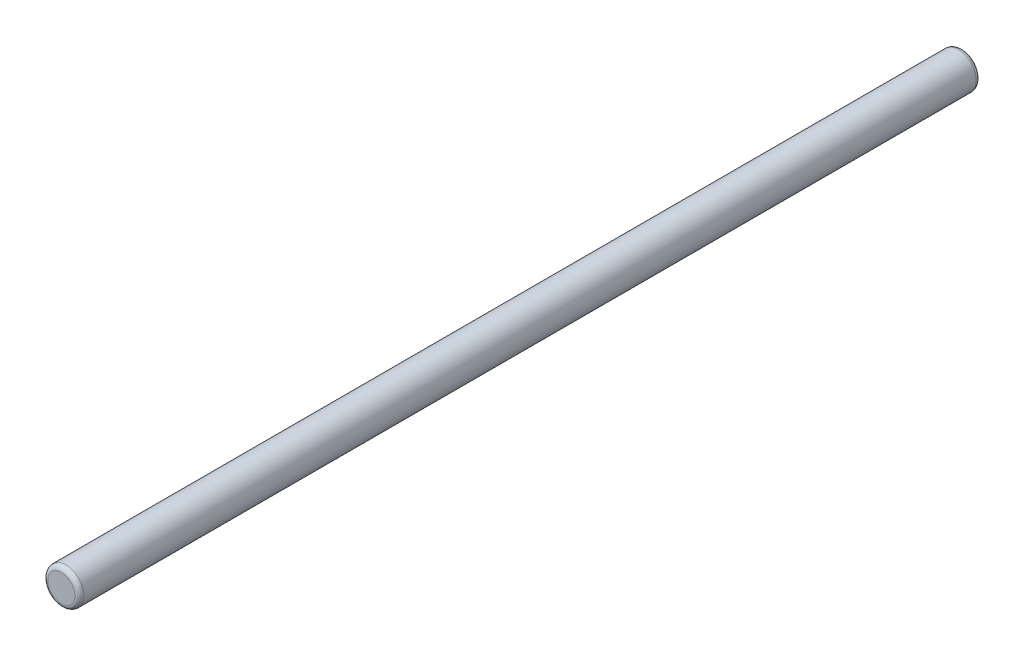
ISO-10303-21;
HEADER;
FILE_DESCRIPTION(('STEP AP214'),'2;1');
FILE_NAME('part.step','',(''),(''),'','','');
FILE_SCHEMA(('AUTOMOTIVE_DESIGN { 1 0 10303 214 1 1 1 1 }'));
ENDSEC;
DATA;
#1=APPLICATION_CONTEXT('core data for automotive mechanical design processes');
#2=APPLICATION_PROTOCOL_DEFINITION('international standard','automotive_design',2000,#1);
#3=PRODUCT_CONTEXT('',#1,'mechanical');
#4=PRODUCT('Part','Part','',(#3));
#5=PRODUCT_RELATED_PRODUCT_CATEGORY('part','',(#4));
#6=PRODUCT_DEFINITION_FORMATION('','',#4);
#7=PRODUCT_DEFINITION_CONTEXT('part definition',#1,'design');
#8=PRODUCT_DEFINITION('design','',#6,#7);
#9=PRODUCT_DEFINITION_SHAPE('','',#8);
#10=(LENGTH_UNIT() NAMED_UNIT(*) SI_UNIT(.MILLI.,.METRE.));
#11=(NAMED_UNIT(*) PLANE_ANGLE_UNIT() SI_UNIT($,.RADIAN.));
#12=(NAMED_UNIT(*) SI_UNIT($,.STERADIAN.) SOLID_ANGLE_UNIT());
#13=UNCERTAINTY_MEASURE_WITH_UNIT(LENGTH_MEASURE(1.E-05),#10,'distance_accuracy_value','');
#14=(GEOMETRIC_REPRESENTATION_CONTEXT(3) GLOBAL_UNCERTAINTY_ASSIGNED_CONTEXT((#13)) GLOBAL_UNIT_ASSIGNED_CONTEXT((#10,
#11,#12)) REPRESENTATION_CONTEXT('',''));
#15=CARTESIAN_POINT('',(0.,0.,0.));
#16=DIRECTION('',(0.,0.,1.));
#17=DIRECTION('',(1.,0.,0.));
#18=AXIS2_PLACEMENT_3D('',#15,#16,#17);
#19=CARTESIAN_POINT('',(0.,0.,200.));
#20=DIRECTION('',(0.,0.,-1.));
#21=DIRECTION('',(-1.,0.,0.));
#22=AXIS2_PLACEMENT_3D('',#19,#20,#21);
#23=PLANE('',#22);
#24=CARTESIAN_POINT('',(0.,0.,200.));
#25=DIRECTION('',(0.,0.,-1.));
#26=DIRECTION('',(1.,0.,0.));
#27=AXIS2_PLACEMENT_3D('',#24,#25,#26);
#28=CIRCLE('',#27,2.99999999999999);
#29=CARTESIAN_POINT('',(2.99999999999999,0.,200.));
#30=VERTEX_POINT('',#29);
#31=EDGE_CURVE('E65',#30,#30,#28,.T.);
#32=ORIENTED_EDGE('',*,*,#31,.F.);
#33=EDGE_LOOP('',(#32));
#34=FACE_BOUND('',#33,.T.);
#35=ADVANCED_FACE('F14',(#34),#23,.F.);
#36=CARTESIAN_POINT('',(0.,0.,0.));
#37=DIRECTION('',(0.,0.,-1.));
#38=DIRECTION('',(-1.,0.,0.));
#39=AXIS2_PLACEMENT_3D('',#36,#37,#38);
#40=PLANE('',#39);
#41=CARTESIAN_POINT('',(0.,0.,0.));
#42=DIRECTION('',(0.,0.,1.));
#43=DIRECTION('',(1.,0.,0.));
#44=AXIS2_PLACEMENT_3D('',#41,#42,#43);
#45=CIRCLE('',#44,2.99999999999999);
#46=CARTESIAN_POINT('',(2.99999999999999,0.,0.));
#47=VERTEX_POINT('',#46);
#48=EDGE_CURVE('E29',#47,#47,#45,.T.);
#49=ORIENTED_EDGE('',*,*,#48,.F.);
#50=EDGE_LOOP('',(#49));
#51=FACE_BOUND('',#50,.T.);
#52=ADVANCED_FACE('F77',(#51),#40,.T.);
#53=CARTESIAN_POINT('',(0.,0.,199.));
#54=DIRECTION('',(0.,0.,-1.));
#55=DIRECTION('',(-1.,0.,0.));
#56=AXIS2_PLACEMENT_3D('',#53,#54,#55);
#57=TOROIDAL_SURFACE('',#56,2.99999999999999,1.);
#58=CARTESIAN_POINT('',(0.,0.,199.));
#59=DIRECTION('',(0.,0.,1.));
#60=DIRECTION('',(1.,0.,0.));
#61=AXIS2_PLACEMENT_3D('',#58,#59,#60);
#62=CIRCLE('',#61,4.);
#63=CARTESIAN_POINT('',(4.,0.,199.));
#64=VERTEX_POINT('',#63);
#65=EDGE_CURVE('E24',#64,#64,#62,.F.);
#66=ORIENTED_EDGE('',*,*,#65,.F.);
#67=EDGE_LOOP('',(#66));
#68=FACE_BOUND('',#67,.T.);
#69=ORIENTED_EDGE('',*,*,#31,.T.);
#70=EDGE_LOOP('',(#69));
#71=FACE_BOUND('',#70,.T.);
#72=ADVANCED_FACE('F46',(#68,#71),#57,.T.);
#73=CARTESIAN_POINT('',(0.,0.,1.));
#74=DIRECTION('',(0.,0.,-1.));
#75=DIRECTION('',(-1.,0.,0.));
#76=AXIS2_PLACEMENT_3D('',#73,#74,#75);
#77=TOROIDAL_SURFACE('',#76,2.99999999999999,1.);
#78=ORIENTED_EDGE('',*,*,#48,.T.);
#79=EDGE_LOOP('',(#78));
#80=FACE_BOUND('',#79,.T.);
#81=CARTESIAN_POINT('',(0.,0.,1.));
#82=DIRECTION('',(0.,0.,1.));
#83=DIRECTION('',(1.,0.,0.));
#84=AXIS2_PLACEMENT_3D('',#81,#82,#83);
#85=CIRCLE('',#84,4.);
#86=CARTESIAN_POINT('',(4.,0.,1.));
#87=VERTEX_POINT('',#86);
#88=EDGE_CURVE('E10',#87,#87,#85,.T.);
#89=ORIENTED_EDGE('',*,*,#88,.F.);
#90=EDGE_LOOP('',(#89));
#91=FACE_BOUND('',#90,.T.);
#92=ADVANCED_FACE('F41',(#80,#91),#77,.T.);
#93=CARTESIAN_POINT('',(0.,0.,0.));
#94=DIRECTION('',(0.,0.,1.));
#95=DIRECTION('',(1.,0.,0.));
#96=AXIS2_PLACEMENT_3D('',#93,#94,#95);
#97=CYLINDRICAL_SURFACE('',#96,4.);
#98=ORIENTED_EDGE('',*,*,#88,.T.);
#99=EDGE_LOOP('',(#98));
#100=FACE_BOUND('',#99,.T.);
#101=ORIENTED_EDGE('',*,*,#65,.T.);
#102=EDGE_LOOP('',(#101));
#103=FACE_BOUND('',#102,.T.);
#104=ADVANCED_FACE('F45',(#100,#103),#97,.T.);
#105=CLOSED_SHELL('',(#35,#52,#72,#92,#104));
#106=MANIFOLD_SOLID_BREP('B1',#105);
#107=ADVANCED_BREP_SHAPE_REPRESENTATION('',(#18,#106),#14);
#108=SHAPE_DEFINITION_REPRESENTATION(#9,#107);
ENDSEC;
END-ISO-10303-21;
